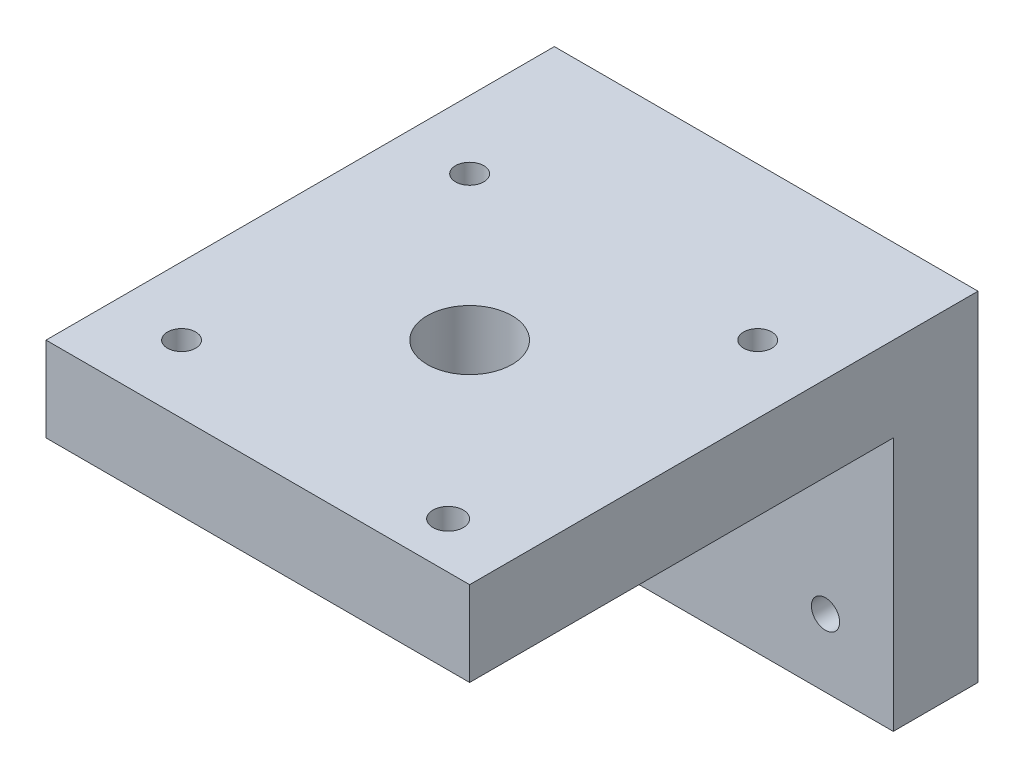
ISO-10303-21;
HEADER;
FILE_DESCRIPTION(('STEP AP214'),'2;1');
FILE_NAME('part.step','',(''),(''),'','','');
FILE_SCHEMA(('AUTOMOTIVE_DESIGN { 1 0 10303 214 1 1 1 1 }'));
ENDSEC;
DATA;
#1=APPLICATION_CONTEXT('core data for automotive mechanical design processes');
#2=APPLICATION_PROTOCOL_DEFINITION('international standard','automotive_design',2000,#1);
#3=PRODUCT_CONTEXT('',#1,'mechanical');
#4=PRODUCT('Part','Part','',(#3));
#5=PRODUCT_RELATED_PRODUCT_CATEGORY('part','',(#4));
#6=PRODUCT_DEFINITION_FORMATION('','',#4);
#7=PRODUCT_DEFINITION_CONTEXT('part definition',#1,'design');
#8=PRODUCT_DEFINITION('design','',#6,#7);
#9=PRODUCT_DEFINITION_SHAPE('','',#8);
#10=(LENGTH_UNIT() NAMED_UNIT(*) SI_UNIT(.MILLI.,.METRE.));
#11=(NAMED_UNIT(*) PLANE_ANGLE_UNIT() SI_UNIT($,.RADIAN.));
#12=(NAMED_UNIT(*) SI_UNIT($,.STERADIAN.) SOLID_ANGLE_UNIT());
#13=UNCERTAINTY_MEASURE_WITH_UNIT(LENGTH_MEASURE(1.E-05),#10,'distance_accuracy_value','');
#14=(GEOMETRIC_REPRESENTATION_CONTEXT(3) GLOBAL_UNCERTAINTY_ASSIGNED_CONTEXT((#13)) GLOBAL_UNIT_ASSIGNED_CONTEXT((#10,
#11,#12)) REPRESENTATION_CONTEXT('',''));
#15=CARTESIAN_POINT('',(0.,0.,0.));
#16=DIRECTION('',(0.,0.,1.));
#17=DIRECTION('',(1.,0.,0.));
#18=AXIS2_PLACEMENT_3D('',#15,#16,#17);
#19=CARTESIAN_POINT('',(0.,10.,0.));
#20=DIRECTION('',(0.,-1.,0.));
#21=DIRECTION('',(0.,0.,-1.));
#22=AXIS2_PLACEMENT_3D('',#19,#20,#21);
#23=PLANE('',#22);
#24=CARTESIAN_POINT('',(-17.,10.,17.));
#25=DIRECTION('',(0.,1.,0.));
#26=DIRECTION('',(0.,0.,1.));
#27=AXIS2_PLACEMENT_3D('',#24,#25,#26);
#28=CIRCLE('',#27,1.666);
#29=CARTESIAN_POINT('',(-17.,10.,18.666));
#30=VERTEX_POINT('',#29);
#31=EDGE_CURVE('E114',#30,#30,#28,.T.);
#32=ORIENTED_EDGE('',*,*,#31,.F.);
#33=EDGE_LOOP('',(#32));
#34=FACE_BOUND('',#33,.T.);
#35=CARTESIAN_POINT('',(-17.,10.,-17.));
#36=DIRECTION('',(0.,1.,0.));
#37=DIRECTION('',(0.,0.,1.));
#38=AXIS2_PLACEMENT_3D('',#35,#36,#37);
#39=CIRCLE('',#38,1.666);
#40=CARTESIAN_POINT('',(-17.,10.,-15.334));
#41=VERTEX_POINT('',#40);
#42=EDGE_CURVE('E103',#41,#41,#39,.T.);
#43=ORIENTED_EDGE('',*,*,#42,.F.);
#44=EDGE_LOOP('',(#43));
#45=FACE_BOUND('',#44,.T.);
#46=DIRECTION('',(0.,0.,-1.));
#47=VECTOR('',#46,1.);
#48=CARTESIAN_POINT('',(25.,10.,25.));
#49=LINE('',#48,#47);
#50=CARTESIAN_POINT('',(25.,10.,25.));
#51=VERTEX_POINT('',#50);
#52=CARTESIAN_POINT('',(25.,10.,-35.));
#53=VERTEX_POINT('',#52);
#54=EDGE_CURVE('E75',#51,#53,#49,.T.);
#55=ORIENTED_EDGE('',*,*,#54,.T.);
#56=DIRECTION('',(1.,0.,0.));
#57=VECTOR('',#56,1.);
#58=CARTESIAN_POINT('',(-25.,10.,-35.));
#59=LINE('',#58,#57);
#60=CARTESIAN_POINT('',(-25.,10.,-35.));
#61=VERTEX_POINT('',#60);
#62=EDGE_CURVE('E131',#61,#53,#59,.T.);
#63=ORIENTED_EDGE('',*,*,#62,.F.);
#64=DIRECTION('',(0.,0.,1.));
#65=VECTOR('',#64,1.);
#66=CARTESIAN_POINT('',(-25.,10.,25.));
#67=LINE('',#66,#65);
#68=CARTESIAN_POINT('',(-25.,10.,25.));
#69=VERTEX_POINT('',#68);
#70=EDGE_CURVE('E99',#61,#69,#67,.T.);
#71=ORIENTED_EDGE('',*,*,#70,.T.);
#72=DIRECTION('',(1.,0.,0.));
#73=VECTOR('',#72,1.);
#74=CARTESIAN_POINT('',(-25.,10.,25.));
#75=LINE('',#74,#73);
#76=EDGE_CURVE('E58',#69,#51,#75,.T.);
#77=ORIENTED_EDGE('',*,*,#76,.T.);
#78=EDGE_LOOP('',(#55,#63,#71,#77));
#79=FACE_BOUND('',#78,.T.);
#80=CARTESIAN_POINT('',(0.,10.,0.));
#81=DIRECTION('',(0.,1.,0.));
#82=DIRECTION('',(0.,0.,1.));
#83=AXIS2_PLACEMENT_3D('',#80,#81,#82);
#84=CIRCLE('',#83,5.);
#85=CARTESIAN_POINT('',(0.,10.,5.));
#86=VERTEX_POINT('',#85);
#87=EDGE_CURVE('E86',#86,#86,#84,.T.);
#88=ORIENTED_EDGE('',*,*,#87,.F.);
#89=EDGE_LOOP('',(#88));
#90=FACE_BOUND('',#89,.T.);
#91=CARTESIAN_POINT('',(17.,10.,-17.));
#92=DIRECTION('',(0.,1.,0.));
#93=DIRECTION('',(0.,0.,1.));
#94=AXIS2_PLACEMENT_3D('',#91,#92,#93);
#95=CIRCLE('',#94,1.666);
#96=CARTESIAN_POINT('',(17.,10.,-15.334));
#97=VERTEX_POINT('',#96);
#98=EDGE_CURVE('E108',#97,#97,#95,.T.);
#99=ORIENTED_EDGE('',*,*,#98,.F.);
#100=EDGE_LOOP('',(#99));
#101=FACE_BOUND('',#100,.T.);
#102=CARTESIAN_POINT('',(17.,10.,19.5369609036188));
#103=DIRECTION('',(0.,1.,0.));
#104=DIRECTION('',(0.,0.,1.));
#105=AXIS2_PLACEMENT_3D('',#102,#103,#104);
#106=CIRCLE('',#105,1.793902258554);
#107=CARTESIAN_POINT('',(17.,10.,21.3308631621728));
#108=VERTEX_POINT('',#107);
#109=EDGE_CURVE('E120',#108,#108,#106,.T.);
#110=ORIENTED_EDGE('',*,*,#109,.F.);
#111=EDGE_LOOP('',(#110));
#112=FACE_BOUND('',#111,.T.);
#113=ADVANCED_FACE('F32',(#34,#45,#79,#90,#101,#112),#23,.F.);
#114=CARTESIAN_POINT('',(0.,0.,0.));
#115=DIRECTION('',(0.,-1.,0.));
#116=DIRECTION('',(0.,0.,-1.));
#117=AXIS2_PLACEMENT_3D('',#114,#115,#116);
#118=PLANE('',#117);
#119=DIRECTION('',(-1.,0.,0.));
#120=VECTOR('',#119,1.);
#121=CARTESIAN_POINT('',(-25.,0.,-25.));
#122=LINE('',#121,#120);
#123=CARTESIAN_POINT('',(25.,0.,-25.));
#124=VERTEX_POINT('',#123);
#125=CARTESIAN_POINT('',(-25.,0.,-25.));
#126=VERTEX_POINT('',#125);
#127=EDGE_CURVE('E49',#124,#126,#122,.T.);
#128=ORIENTED_EDGE('',*,*,#127,.F.);
#129=DIRECTION('',(0.,0.,-1.));
#130=VECTOR('',#129,1.);
#131=CARTESIAN_POINT('',(25.,0.,25.));
#132=LINE('',#131,#130);
#133=CARTESIAN_POINT('',(25.,0.,25.));
#134=VERTEX_POINT('',#133);
#135=EDGE_CURVE('E80',#134,#124,#132,.T.);
#136=ORIENTED_EDGE('',*,*,#135,.F.);
#137=DIRECTION('',(1.,0.,0.));
#138=VECTOR('',#137,1.);
#139=CARTESIAN_POINT('',(-25.,0.,25.));
#140=LINE('',#139,#138);
#141=CARTESIAN_POINT('',(-25.,0.,25.));
#142=VERTEX_POINT('',#141);
#143=EDGE_CURVE('E70',#142,#134,#140,.T.);
#144=ORIENTED_EDGE('',*,*,#143,.F.);
#145=DIRECTION('',(0.,0.,1.));
#146=VECTOR('',#145,1.);
#147=CARTESIAN_POINT('',(-25.,0.,25.));
#148=LINE('',#147,#146);
#149=EDGE_CURVE('E76',#126,#142,#148,.T.);
#150=ORIENTED_EDGE('',*,*,#149,.F.);
#151=EDGE_LOOP('',(#128,#136,#144,#150));
#152=FACE_BOUND('',#151,.T.);
#153=CARTESIAN_POINT('',(-17.,0.,17.));
#154=DIRECTION('',(0.,1.,0.));
#155=DIRECTION('',(0.,0.,1.));
#156=AXIS2_PLACEMENT_3D('',#153,#154,#155);
#157=CIRCLE('',#156,1.666);
#158=CARTESIAN_POINT('',(-17.,0.,18.666));
#159=VERTEX_POINT('',#158);
#160=EDGE_CURVE('E117',#159,#159,#157,.T.);
#161=ORIENTED_EDGE('',*,*,#160,.T.);
#162=EDGE_LOOP('',(#161));
#163=FACE_BOUND('',#162,.T.);
#164=CARTESIAN_POINT('',(-17.,0.,-17.));
#165=DIRECTION('',(0.,1.,0.));
#166=DIRECTION('',(0.,0.,1.));
#167=AXIS2_PLACEMENT_3D('',#164,#165,#166);
#168=CIRCLE('',#167,1.666);
#169=CARTESIAN_POINT('',(-17.,0.,-15.334));
#170=VERTEX_POINT('',#169);
#171=EDGE_CURVE('E105',#170,#170,#168,.T.);
#172=ORIENTED_EDGE('',*,*,#171,.T.);
#173=EDGE_LOOP('',(#172));
#174=FACE_BOUND('',#173,.T.);
#175=CARTESIAN_POINT('',(0.,0.,0.));
#176=DIRECTION('',(0.,1.,0.));
#177=DIRECTION('',(0.,0.,1.));
#178=AXIS2_PLACEMENT_3D('',#175,#176,#177);
#179=CIRCLE('',#178,5.);
#180=CARTESIAN_POINT('',(0.,0.,5.));
#181=VERTEX_POINT('',#180);
#182=EDGE_CURVE('E90',#181,#181,#179,.T.);
#183=ORIENTED_EDGE('',*,*,#182,.T.);
#184=EDGE_LOOP('',(#183));
#185=FACE_BOUND('',#184,.T.);
#186=CARTESIAN_POINT('',(17.,0.,-17.));
#187=DIRECTION('',(0.,1.,0.));
#188=DIRECTION('',(0.,0.,1.));
#189=AXIS2_PLACEMENT_3D('',#186,#187,#188);
#190=CIRCLE('',#189,1.666);
#191=CARTESIAN_POINT('',(17.,0.,-15.334));
#192=VERTEX_POINT('',#191);
#193=EDGE_CURVE('E111',#192,#192,#190,.T.);
#194=ORIENTED_EDGE('',*,*,#193,.T.);
#195=EDGE_LOOP('',(#194));
#196=FACE_BOUND('',#195,.T.);
#197=CARTESIAN_POINT('',(17.,0.,19.5369609036188));
#198=DIRECTION('',(0.,1.,0.));
#199=DIRECTION('',(0.,0.,1.));
#200=AXIS2_PLACEMENT_3D('',#197,#198,#199);
#201=CIRCLE('',#200,1.793902258554);
#202=CARTESIAN_POINT('',(17.,0.,21.3308631621728));
#203=VERTEX_POINT('',#202);
#204=EDGE_CURVE('E123',#203,#203,#201,.T.);
#205=ORIENTED_EDGE('',*,*,#204,.T.);
#206=EDGE_LOOP('',(#205));
#207=FACE_BOUND('',#206,.T.);
#208=ADVANCED_FACE('F84',(#152,#163,#174,#185,#196,#207),#118,.T.);
#209=CARTESIAN_POINT('',(25.,10.,25.));
#210=DIRECTION('',(-1.,0.,0.));
#211=DIRECTION('',(0.,0.,1.));
#212=AXIS2_PLACEMENT_3D('',#209,#210,#211);
#213=PLANE('',#212);
#214=ORIENTED_EDGE('',*,*,#135,.T.);
#215=DIRECTION('',(0.,1.,0.));
#216=VECTOR('',#215,1.);
#217=CARTESIAN_POINT('',(25.,-30.,-25.));
#218=LINE('',#217,#216);
#219=CARTESIAN_POINT('',(25.,-30.,-25.));
#220=VERTEX_POINT('',#219);
#221=EDGE_CURVE('E137',#220,#124,#218,.T.);
#222=ORIENTED_EDGE('',*,*,#221,.F.);
#223=DIRECTION('',(0.,0.,1.));
#224=VECTOR('',#223,1.);
#225=CARTESIAN_POINT('',(25.,-30.,-35.));
#226=LINE('',#225,#224);
#227=CARTESIAN_POINT('',(25.,-30.,-35.));
#228=VERTEX_POINT('',#227);
#229=EDGE_CURVE('E159',#228,#220,#226,.T.);
#230=ORIENTED_EDGE('',*,*,#229,.F.);
#231=DIRECTION('',(0.,-1.,0.));
#232=VECTOR('',#231,1.);
#233=CARTESIAN_POINT('',(25.,0.,-35.));
#234=LINE('',#233,#232);
#235=EDGE_CURVE('E126',#53,#228,#234,.T.);
#236=ORIENTED_EDGE('',*,*,#235,.F.);
#237=ORIENTED_EDGE('',*,*,#54,.F.);
#238=DIRECTION('',(0.,-1.,0.));
#239=VECTOR('',#238,1.);
#240=CARTESIAN_POINT('',(25.,10.,25.));
#241=LINE('',#240,#239);
#242=EDGE_CURVE('E41',#51,#134,#241,.T.);
#243=ORIENTED_EDGE('',*,*,#242,.T.);
#244=EDGE_LOOP('',(#214,#222,#230,#236,#237,#243));
#245=FACE_BOUND('',#244,.T.);
#246=ADVANCED_FACE('F34',(#245),#213,.F.);
#247=CARTESIAN_POINT('',(-25.,10.,25.));
#248=DIRECTION('',(1.,0.,0.));
#249=DIRECTION('',(0.,0.,-1.));
#250=AXIS2_PLACEMENT_3D('',#247,#248,#249);
#251=PLANE('',#250);
#252=DIRECTION('',(0.,1.,0.));
#253=VECTOR('',#252,1.);
#254=CARTESIAN_POINT('',(-25.,0.,-35.));
#255=LINE('',#254,#253);
#256=CARTESIAN_POINT('',(-25.,-30.,-35.));
#257=VERTEX_POINT('',#256);
#258=EDGE_CURVE('E134',#257,#61,#255,.T.);
#259=ORIENTED_EDGE('',*,*,#258,.F.);
#260=DIRECTION('',(0.,0.,-1.));
#261=VECTOR('',#260,1.);
#262=CARTESIAN_POINT('',(-25.,-30.,-35.));
#263=LINE('',#262,#261);
#264=CARTESIAN_POINT('',(-25.,-30.,-25.));
#265=VERTEX_POINT('',#264);
#266=EDGE_CURVE('E143',#265,#257,#263,.T.);
#267=ORIENTED_EDGE('',*,*,#266,.F.);
#268=DIRECTION('',(0.,1.,0.));
#269=VECTOR('',#268,1.);
#270=CARTESIAN_POINT('',(-25.,-30.,-25.));
#271=LINE('',#270,#269);
#272=EDGE_CURVE('E145',#265,#126,#271,.T.);
#273=ORIENTED_EDGE('',*,*,#272,.T.);
#274=ORIENTED_EDGE('',*,*,#149,.T.);
#275=DIRECTION('',(0.,-1.,0.));
#276=VECTOR('',#275,1.);
#277=CARTESIAN_POINT('',(-25.,10.,25.));
#278=LINE('',#277,#276);
#279=EDGE_CURVE('E11',#69,#142,#278,.T.);
#280=ORIENTED_EDGE('',*,*,#279,.F.);
#281=ORIENTED_EDGE('',*,*,#70,.F.);
#282=EDGE_LOOP('',(#259,#267,#273,#274,#280,#281));
#283=FACE_BOUND('',#282,.T.);
#284=ADVANCED_FACE('F182',(#283),#251,.F.);
#285=CARTESIAN_POINT('',(-25.,10.,25.));
#286=DIRECTION('',(0.,0.,-1.));
#287=DIRECTION('',(-1.,0.,0.));
#288=AXIS2_PLACEMENT_3D('',#285,#286,#287);
#289=PLANE('',#288);
#290=ORIENTED_EDGE('',*,*,#143,.T.);
#291=ORIENTED_EDGE('',*,*,#242,.F.);
#292=ORIENTED_EDGE('',*,*,#76,.F.);
#293=ORIENTED_EDGE('',*,*,#279,.T.);
#294=EDGE_LOOP('',(#290,#291,#292,#293));
#295=FACE_BOUND('',#294,.T.);
#296=ADVANCED_FACE('F72',(#295),#289,.F.);
#297=CARTESIAN_POINT('',(0.,10.,0.));
#298=DIRECTION('',(0.,-1.,0.));
#299=DIRECTION('',(0.,0.,-1.));
#300=AXIS2_PLACEMENT_3D('',#297,#298,#299);
#301=CYLINDRICAL_SURFACE('',#300,5.);
#302=ORIENTED_EDGE('',*,*,#87,.T.);
#303=EDGE_LOOP('',(#302));
#304=FACE_BOUND('',#303,.T.);
#305=ORIENTED_EDGE('',*,*,#182,.F.);
#306=EDGE_LOOP('',(#305));
#307=FACE_BOUND('',#306,.T.);
#308=ADVANCED_FACE('F211',(#304,#307),#301,.F.);
#309=CARTESIAN_POINT('',(-17.,10.,-17.));
#310=DIRECTION('',(0.,-1.,0.));
#311=DIRECTION('',(0.,0.,-1.));
#312=AXIS2_PLACEMENT_3D('',#309,#310,#311);
#313=CYLINDRICAL_SURFACE('',#312,1.666);
#314=ORIENTED_EDGE('',*,*,#42,.T.);
#315=EDGE_LOOP('',(#314));
#316=FACE_BOUND('',#315,.T.);
#317=ORIENTED_EDGE('',*,*,#171,.F.);
#318=EDGE_LOOP('',(#317));
#319=FACE_BOUND('',#318,.T.);
#320=ADVANCED_FACE('F262',(#316,#319),#313,.F.);
#321=CARTESIAN_POINT('',(17.,10.,-17.));
#322=DIRECTION('',(0.,-1.,0.));
#323=DIRECTION('',(0.,0.,-1.));
#324=AXIS2_PLACEMENT_3D('',#321,#322,#323);
#325=CYLINDRICAL_SURFACE('',#324,1.666);
#326=ORIENTED_EDGE('',*,*,#98,.T.);
#327=EDGE_LOOP('',(#326));
#328=FACE_BOUND('',#327,.T.);
#329=ORIENTED_EDGE('',*,*,#193,.F.);
#330=EDGE_LOOP('',(#329));
#331=FACE_BOUND('',#330,.T.);
#332=ADVANCED_FACE('F252',(#328,#331),#325,.F.);
#333=CARTESIAN_POINT('',(-17.,10.,17.));
#334=DIRECTION('',(0.,-1.,0.));
#335=DIRECTION('',(0.,0.,-1.));
#336=AXIS2_PLACEMENT_3D('',#333,#334,#335);
#337=CYLINDRICAL_SURFACE('',#336,1.666);
#338=ORIENTED_EDGE('',*,*,#31,.T.);
#339=EDGE_LOOP('',(#338));
#340=FACE_BOUND('',#339,.T.);
#341=ORIENTED_EDGE('',*,*,#160,.F.);
#342=EDGE_LOOP('',(#341));
#343=FACE_BOUND('',#342,.T.);
#344=ADVANCED_FACE('F242',(#340,#343),#337,.F.);
#345=CARTESIAN_POINT('',(17.,10.,19.5369609036188));
#346=DIRECTION('',(0.,-1.,0.));
#347=DIRECTION('',(0.,0.,-1.));
#348=AXIS2_PLACEMENT_3D('',#345,#346,#347);
#349=CYLINDRICAL_SURFACE('',#348,1.793902258554);
#350=ORIENTED_EDGE('',*,*,#109,.T.);
#351=EDGE_LOOP('',(#350));
#352=FACE_BOUND('',#351,.T.);
#353=ORIENTED_EDGE('',*,*,#204,.F.);
#354=EDGE_LOOP('',(#353));
#355=FACE_BOUND('',#354,.T.);
#356=ADVANCED_FACE('F239',(#352,#355),#349,.F.);
#357=CARTESIAN_POINT('',(0.,0.,-35.));
#358=DIRECTION('',(0.,0.,-1.));
#359=DIRECTION('',(-1.,0.,0.));
#360=AXIS2_PLACEMENT_3D('',#357,#358,#359);
#361=PLANE('',#360);
#362=CARTESIAN_POINT('',(-17.,-22.,-35.));
#363=DIRECTION('',(0.,0.,-1.));
#364=DIRECTION('',(-1.,0.,0.));
#365=AXIS2_PLACEMENT_3D('',#362,#363,#364);
#366=CIRCLE('',#365,1.666);
#367=CARTESIAN_POINT('',(-18.666,-22.,-35.));
#368=VERTEX_POINT('',#367);
#369=EDGE_CURVE('E357',#368,#368,#366,.T.);
#370=ORIENTED_EDGE('',*,*,#369,.F.);
#371=EDGE_LOOP('',(#370));
#372=FACE_BOUND('',#371,.T.);
#373=CARTESIAN_POINT('',(0.,-10.,-35.));
#374=DIRECTION('',(0.,0.,-1.));
#375=DIRECTION('',(-1.,0.,0.));
#376=AXIS2_PLACEMENT_3D('',#373,#374,#375);
#377=CIRCLE('',#376,1.666);
#378=CARTESIAN_POINT('',(-1.666,-10.,-35.));
#379=VERTEX_POINT('',#378);
#380=EDGE_CURVE('E367',#379,#379,#377,.T.);
#381=ORIENTED_EDGE('',*,*,#380,.F.);
#382=EDGE_LOOP('',(#381));
#383=FACE_BOUND('',#382,.T.);
#384=CARTESIAN_POINT('',(17.,-22.,-35.));
#385=DIRECTION('',(0.,0.,-1.));
#386=DIRECTION('',(-1.,0.,0.));
#387=AXIS2_PLACEMENT_3D('',#384,#385,#386);
#388=CIRCLE('',#387,1.666);
#389=CARTESIAN_POINT('',(15.334,-22.,-35.));
#390=VERTEX_POINT('',#389);
#391=EDGE_CURVE('E144',#390,#390,#388,.T.);
#392=ORIENTED_EDGE('',*,*,#391,.F.);
#393=EDGE_LOOP('',(#392));
#394=FACE_BOUND('',#393,.T.);
#395=ORIENTED_EDGE('',*,*,#258,.T.);
#396=ORIENTED_EDGE('',*,*,#62,.T.);
#397=ORIENTED_EDGE('',*,*,#235,.T.);
#398=DIRECTION('',(1.,0.,0.));
#399=VECTOR('',#398,1.);
#400=CARTESIAN_POINT('',(-25.,-30.,-35.));
#401=LINE('',#400,#399);
#402=EDGE_CURVE('E178',#257,#228,#401,.T.);
#403=ORIENTED_EDGE('',*,*,#402,.F.);
#404=EDGE_LOOP('',(#395,#396,#397,#403));
#405=FACE_BOUND('',#404,.T.);
#406=ADVANCED_FACE('F175',(#372,#383,#394,#405),#361,.T.);
#407=CARTESIAN_POINT('',(-25.,-30.,-25.));
#408=DIRECTION('',(0.,0.,-1.));
#409=DIRECTION('',(-1.,0.,0.));
#410=AXIS2_PLACEMENT_3D('',#407,#408,#409);
#411=PLANE('',#410);
#412=CARTESIAN_POINT('',(-17.,-22.,-25.));
#413=DIRECTION('',(0.,0.,1.));
#414=DIRECTION('',(1.,0.,0.));
#415=AXIS2_PLACEMENT_3D('',#412,#413,#414);
#416=CIRCLE('',#415,1.666);
#417=CARTESIAN_POINT('',(-15.334,-22.,-25.));
#418=VERTEX_POINT('',#417);
#419=EDGE_CURVE('E360',#418,#418,#416,.T.);
#420=ORIENTED_EDGE('',*,*,#419,.F.);
#421=EDGE_LOOP('',(#420));
#422=FACE_BOUND('',#421,.T.);
#423=CARTESIAN_POINT('',(0.,-10.,-25.));
#424=DIRECTION('',(0.,0.,1.));
#425=DIRECTION('',(1.,0.,0.));
#426=AXIS2_PLACEMENT_3D('',#423,#424,#425);
#427=CIRCLE('',#426,1.666);
#428=CARTESIAN_POINT('',(1.666,-10.,-25.));
#429=VERTEX_POINT('',#428);
#430=EDGE_CURVE('E362',#429,#429,#427,.T.);
#431=ORIENTED_EDGE('',*,*,#430,.F.);
#432=EDGE_LOOP('',(#431));
#433=FACE_BOUND('',#432,.T.);
#434=CARTESIAN_POINT('',(17.,-22.,-25.));
#435=DIRECTION('',(0.,0.,1.));
#436=DIRECTION('',(1.,0.,0.));
#437=AXIS2_PLACEMENT_3D('',#434,#435,#436);
#438=CIRCLE('',#437,1.666);
#439=CARTESIAN_POINT('',(18.666,-22.,-25.));
#440=VERTEX_POINT('',#439);
#441=EDGE_CURVE('E369',#440,#440,#438,.T.);
#442=ORIENTED_EDGE('',*,*,#441,.F.);
#443=EDGE_LOOP('',(#442));
#444=FACE_BOUND('',#443,.T.);
#445=ORIENTED_EDGE('',*,*,#127,.T.);
#446=ORIENTED_EDGE('',*,*,#272,.F.);
#447=DIRECTION('',(-1.,0.,0.));
#448=VECTOR('',#447,1.);
#449=CARTESIAN_POINT('',(-25.,-30.,-25.));
#450=LINE('',#449,#448);
#451=EDGE_CURVE('E140',#220,#265,#450,.T.);
#452=ORIENTED_EDGE('',*,*,#451,.F.);
#453=ORIENTED_EDGE('',*,*,#221,.T.);
#454=EDGE_LOOP('',(#445,#446,#452,#453));
#455=FACE_BOUND('',#454,.T.);
#456=ADVANCED_FACE('F151',(#422,#433,#444,#455),#411,.F.);
#457=CARTESIAN_POINT('',(0.,-30.,0.));
#458=DIRECTION('',(0.,1.,0.));
#459=DIRECTION('',(0.,0.,1.));
#460=AXIS2_PLACEMENT_3D('',#457,#458,#459);
#461=PLANE('',#460);
#462=ORIENTED_EDGE('',*,*,#266,.T.);
#463=ORIENTED_EDGE('',*,*,#402,.T.);
#464=ORIENTED_EDGE('',*,*,#229,.T.);
#465=ORIENTED_EDGE('',*,*,#451,.T.);
#466=EDGE_LOOP('',(#462,#463,#464,#465));
#467=FACE_BOUND('',#466,.T.);
#468=ADVANCED_FACE('F187',(#467),#461,.F.);
#469=CARTESIAN_POINT('',(17.,-22.,-55.));
#470=DIRECTION('',(0.,0.,1.));
#471=DIRECTION('',(1.,0.,0.));
#472=AXIS2_PLACEMENT_3D('',#469,#470,#471);
#473=CYLINDRICAL_SURFACE('',#472,1.666);
#474=ORIENTED_EDGE('',*,*,#391,.T.);
#475=EDGE_LOOP('',(#474));
#476=FACE_BOUND('',#475,.T.);
#477=ORIENTED_EDGE('',*,*,#441,.T.);
#478=EDGE_LOOP('',(#477));
#479=FACE_BOUND('',#478,.T.);
#480=ADVANCED_FACE('F189',(#476,#479),#473,.F.);
#481=CARTESIAN_POINT('',(0.,-10.,-55.));
#482=DIRECTION('',(0.,0.,1.));
#483=DIRECTION('',(1.,0.,0.));
#484=AXIS2_PLACEMENT_3D('',#481,#482,#483);
#485=CYLINDRICAL_SURFACE('',#484,1.666);
#486=ORIENTED_EDGE('',*,*,#380,.T.);
#487=EDGE_LOOP('',(#486));
#488=FACE_BOUND('',#487,.T.);
#489=ORIENTED_EDGE('',*,*,#430,.T.);
#490=EDGE_LOOP('',(#489));
#491=FACE_BOUND('',#490,.T.);
#492=ADVANCED_FACE('F195',(#488,#491),#485,.F.);
#493=CARTESIAN_POINT('',(-17.,-22.,-55.));
#494=DIRECTION('',(0.,0.,1.));
#495=DIRECTION('',(1.,0.,0.));
#496=AXIS2_PLACEMENT_3D('',#493,#494,#495);
#497=CYLINDRICAL_SURFACE('',#496,1.666);
#498=ORIENTED_EDGE('',*,*,#369,.T.);
#499=EDGE_LOOP('',(#498));
#500=FACE_BOUND('',#499,.T.);
#501=ORIENTED_EDGE('',*,*,#419,.T.);
#502=EDGE_LOOP('',(#501));
#503=FACE_BOUND('',#502,.T.);
#504=ADVANCED_FACE('F340',(#500,#503),#497,.F.);
#505=CLOSED_SHELL('',(#113,#208,#246,#284,#296,#308,#320,#332,#344,#356,#406,#456,#468,#480,
#492,#504));
#506=MANIFOLD_SOLID_BREP('B2',#505);
#507=ADVANCED_BREP_SHAPE_REPRESENTATION('',(#18,#506),#14);
#508=SHAPE_DEFINITION_REPRESENTATION(#9,#507);
ENDSEC;
END-ISO-10303-21;
